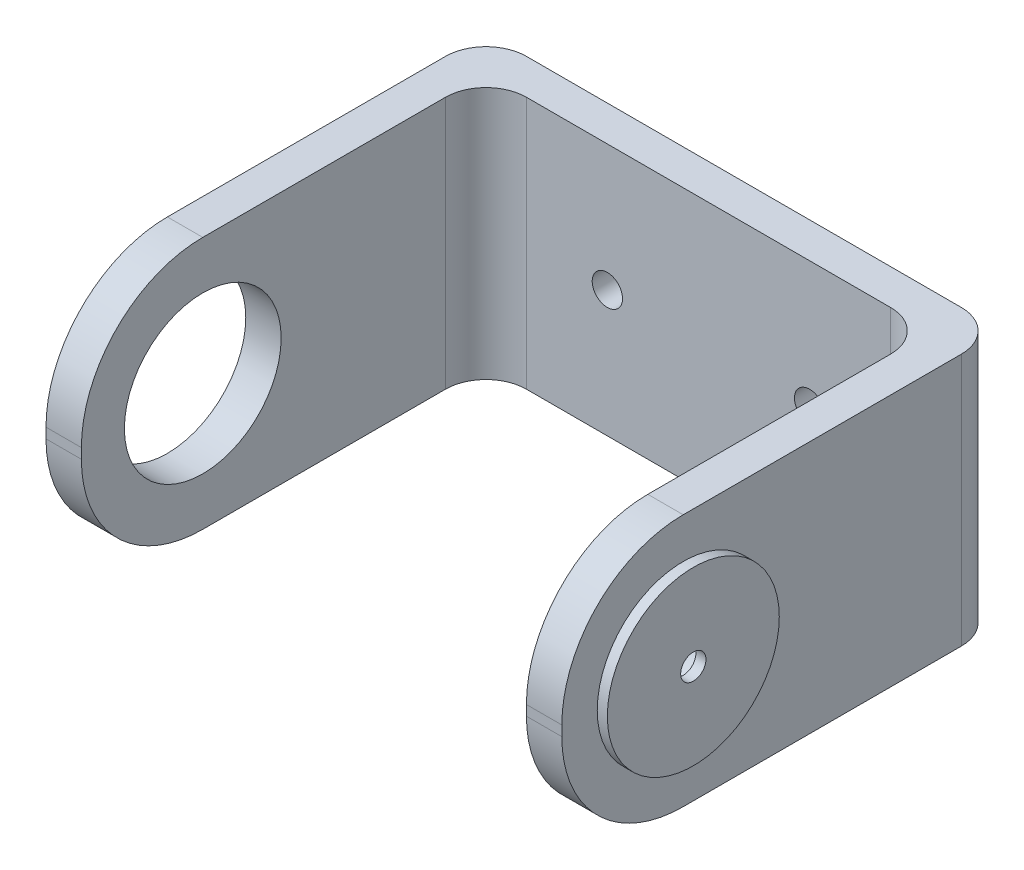
ISO-10303-21;
HEADER;
FILE_DESCRIPTION(('STEP AP214'),'2;1');
FILE_NAME('part.step','',(''),(''),'','','');
FILE_SCHEMA(('AUTOMOTIVE_DESIGN { 1 0 10303 214 1 1 1 1 }'));
ENDSEC;
DATA;
#1=APPLICATION_CONTEXT('core data for automotive mechanical design processes');
#2=APPLICATION_PROTOCOL_DEFINITION('international standard','automotive_design',2000,#1);
#3=PRODUCT_CONTEXT('',#1,'mechanical');
#4=PRODUCT('Part','Part','',(#3));
#5=PRODUCT_RELATED_PRODUCT_CATEGORY('part','',(#4));
#6=PRODUCT_DEFINITION_FORMATION('','',#4);
#7=PRODUCT_DEFINITION_CONTEXT('part definition',#1,'design');
#8=PRODUCT_DEFINITION('design','',#6,#7);
#9=PRODUCT_DEFINITION_SHAPE('','',#8);
#10=(LENGTH_UNIT() NAMED_UNIT(*) SI_UNIT(.MILLI.,.METRE.));
#11=(NAMED_UNIT(*) PLANE_ANGLE_UNIT() SI_UNIT($,.RADIAN.));
#12=(NAMED_UNIT(*) SI_UNIT($,.STERADIAN.) SOLID_ANGLE_UNIT());
#13=UNCERTAINTY_MEASURE_WITH_UNIT(LENGTH_MEASURE(1.E-05),#10,'distance_accuracy_value','');
#14=(GEOMETRIC_REPRESENTATION_CONTEXT(3) GLOBAL_UNCERTAINTY_ASSIGNED_CONTEXT((#13)) GLOBAL_UNIT_ASSIGNED_CONTEXT((#10,
#11,#12)) REPRESENTATION_CONTEXT('',''));
#15=CARTESIAN_POINT('',(0.,0.,0.));
#16=DIRECTION('',(0.,0.,1.));
#17=DIRECTION('',(1.,0.,0.));
#18=AXIS2_PLACEMENT_3D('',#15,#16,#17);
#19=CARTESIAN_POINT('',(0.,25.,40.));
#20=DIRECTION('',(0.,0.,-1.));
#21=DIRECTION('',(-1.,0.,0.));
#22=AXIS2_PLACEMENT_3D('',#19,#20,#21);
#23=PLANE('',#22);
#24=DIRECTION('',(0.,-1.,0.));
#25=VECTOR('',#24,1.);
#26=CARTESIAN_POINT('',(-25.5,25.,40.));
#27=LINE('',#26,#25);
#28=CARTESIAN_POINT('',(-25.5,13.,40.));
#29=VERTEX_POINT('',#28);
#30=CARTESIAN_POINT('',(-25.5,12.,40.));
#31=VERTEX_POINT('',#30);
#32=EDGE_CURVE('E195',#29,#31,#27,.T.);
#33=ORIENTED_EDGE('',*,*,#32,.T.);
#34=DIRECTION('',(1.,0.,0.));
#35=VECTOR('',#34,1.);
#36=CARTESIAN_POINT('',(0.,12.,40.));
#37=LINE('',#36,#35);
#38=CARTESIAN_POINT('',(-22.,12.,40.));
#39=VERTEX_POINT('',#38);
#40=EDGE_CURVE('E160',#31,#39,#37,.T.);
#41=ORIENTED_EDGE('',*,*,#40,.T.);
#42=DIRECTION('',(0.,-1.,0.));
#43=VECTOR('',#42,1.);
#44=CARTESIAN_POINT('',(-22.,25.,40.));
#45=LINE('',#44,#43);
#46=CARTESIAN_POINT('',(-22.,13.,40.));
#47=VERTEX_POINT('',#46);
#48=EDGE_CURVE('E171',#47,#39,#45,.T.);
#49=ORIENTED_EDGE('',*,*,#48,.F.);
#50=DIRECTION('',(1.,0.,0.));
#51=VECTOR('',#50,1.);
#52=CARTESIAN_POINT('',(-25.5,13.,40.));
#53=LINE('',#52,#51);
#54=EDGE_CURVE('E154',#47,#29,#53,.F.);
#55=ORIENTED_EDGE('',*,*,#54,.T.);
#56=EDGE_LOOP('',(#33,#41,#49,#55));
#57=FACE_BOUND('',#56,.T.);
#58=ADVANCED_FACE('F34',(#57),#23,.F.);
#59=CARTESIAN_POINT('',(-22.,25.,0.));
#60=DIRECTION('',(-1.,0.,0.));
#61=DIRECTION('',(0.,0.,1.));
#62=AXIS2_PLACEMENT_3D('',#59,#60,#61);
#63=PLANE('',#62);
#64=CARTESIAN_POINT('',(-22.,12.5,28.));
#65=DIRECTION('',(-1.,0.,0.));
#66=DIRECTION('',(0.,0.,1.));
#67=AXIS2_PLACEMENT_3D('',#64,#65,#66);
#68=CIRCLE('',#67,7.75);
#69=CARTESIAN_POINT('',(-22.,12.5,35.75));
#70=VERTEX_POINT('',#69);
#71=EDGE_CURVE('E186',#70,#70,#68,.T.);
#72=ORIENTED_EDGE('',*,*,#71,.T.);
#73=EDGE_LOOP('',(#72));
#74=FACE_BOUND('',#73,.T.);
#75=DIRECTION('',(0.,0.,-1.));
#76=VECTOR('',#75,1.);
#77=CARTESIAN_POINT('',(-22.,0.,0.));
#78=LINE('',#77,#76);
#79=CARTESIAN_POINT('',(-22.,0.,28.));
#80=VERTEX_POINT('',#79);
#81=CARTESIAN_POINT('',(-22.,0.,4.));
#82=VERTEX_POINT('',#81);
#83=EDGE_CURVE('E196',#80,#82,#78,.T.);
#84=ORIENTED_EDGE('',*,*,#83,.T.);
#85=DIRECTION('',(0.,-1.,0.));
#86=VECTOR('',#85,1.);
#87=CARTESIAN_POINT('',(-22.,25.,4.));
#88=LINE('',#87,#86);
#89=CARTESIAN_POINT('',(-22.,25.,4.));
#90=VERTEX_POINT('',#89);
#91=EDGE_CURVE('E176',#82,#90,#88,.F.);
#92=ORIENTED_EDGE('',*,*,#91,.T.);
#93=DIRECTION('',(0.,0.,-1.));
#94=VECTOR('',#93,1.);
#95=CARTESIAN_POINT('',(-22.,25.,0.));
#96=LINE('',#95,#94);
#97=CARTESIAN_POINT('',(-22.,25.,28.));
#98=VERTEX_POINT('',#97);
#99=EDGE_CURVE('E165',#98,#90,#96,.T.);
#100=ORIENTED_EDGE('',*,*,#99,.F.);
#101=CARTESIAN_POINT('',(-22.,13.,28.));
#102=DIRECTION('',(-1.,0.,0.));
#103=DIRECTION('',(0.,0.,1.));
#104=AXIS2_PLACEMENT_3D('',#101,#102,#103);
#105=CIRCLE('',#104,12.);
#106=EDGE_CURVE('E149',#98,#47,#105,.F.);
#107=ORIENTED_EDGE('',*,*,#106,.T.);
#108=ORIENTED_EDGE('',*,*,#48,.T.);
#109=CARTESIAN_POINT('',(-22.,12.,28.));
#110=DIRECTION('',(-1.,0.,0.));
#111=DIRECTION('',(0.,0.,1.));
#112=AXIS2_PLACEMENT_3D('',#109,#110,#111);
#113=CIRCLE('',#112,12.);
#114=EDGE_CURVE('E159',#39,#80,#113,.F.);
#115=ORIENTED_EDGE('',*,*,#114,.T.);
#116=EDGE_LOOP('',(#84,#92,#100,#107,#108,#115));
#117=FACE_BOUND('',#116,.T.);
#118=ADVANCED_FACE('F174',(#74,#117),#63,.F.);
#119=CARTESIAN_POINT('',(0.,25.,0.));
#120=DIRECTION('',(0.,0.,-1.));
#121=DIRECTION('',(-1.,0.,0.));
#122=AXIS2_PLACEMENT_3D('',#119,#120,#121);
#123=PLANE('',#122);
#124=CARTESIAN_POINT('',(10.,12.5,0.));
#125=DIRECTION('',(0.,0.,-1.));
#126=DIRECTION('',(-1.,0.,0.));
#127=AXIS2_PLACEMENT_3D('',#124,#125,#126);
#128=CIRCLE('',#127,1.5);
#129=CARTESIAN_POINT('',(8.5,12.5,0.));
#130=VERTEX_POINT('',#129);
#131=EDGE_CURVE('E416',#130,#130,#128,.T.);
#132=ORIENTED_EDGE('',*,*,#131,.T.);
#133=EDGE_LOOP('',(#132));
#134=FACE_BOUND('',#133,.T.);
#135=CARTESIAN_POINT('',(-10.,12.5,0.));
#136=DIRECTION('',(0.,0.,-1.));
#137=DIRECTION('',(-1.,0.,0.));
#138=AXIS2_PLACEMENT_3D('',#135,#136,#137);
#139=CIRCLE('',#138,1.5);
#140=CARTESIAN_POINT('',(-11.5,12.5,0.));
#141=VERTEX_POINT('',#140);
#142=EDGE_CURVE('E419',#141,#141,#139,.T.);
#143=ORIENTED_EDGE('',*,*,#142,.T.);
#144=EDGE_LOOP('',(#143));
#145=FACE_BOUND('',#144,.T.);
#146=DIRECTION('',(1.,0.,0.));
#147=VECTOR('',#146,1.);
#148=CARTESIAN_POINT('',(0.,0.,0.));
#149=LINE('',#148,#147);
#150=CARTESIAN_POINT('',(-18.,0.,0.));
#151=VERTEX_POINT('',#150);
#152=CARTESIAN_POINT('',(18.,0.,0.));
#153=VERTEX_POINT('',#152);
#154=EDGE_CURVE('E198',#151,#153,#149,.T.);
#155=ORIENTED_EDGE('',*,*,#154,.T.);
#156=DIRECTION('',(0.,-1.,0.));
#157=VECTOR('',#156,1.);
#158=CARTESIAN_POINT('',(18.,25.,0.));
#159=LINE('',#158,#157);
#160=CARTESIAN_POINT('',(18.,25.,0.));
#161=VERTEX_POINT('',#160);
#162=EDGE_CURVE('E252',#153,#161,#159,.F.);
#163=ORIENTED_EDGE('',*,*,#162,.T.);
#164=DIRECTION('',(1.,0.,0.));
#165=VECTOR('',#164,1.);
#166=CARTESIAN_POINT('',(0.,25.,0.));
#167=LINE('',#166,#165);
#168=CARTESIAN_POINT('',(-18.,25.,0.));
#169=VERTEX_POINT('',#168);
#170=EDGE_CURVE('E177',#169,#161,#167,.T.);
#171=ORIENTED_EDGE('',*,*,#170,.F.);
#172=DIRECTION('',(0.,-1.,0.));
#173=VECTOR('',#172,1.);
#174=CARTESIAN_POINT('',(-18.,0.,0.));
#175=LINE('',#174,#173);
#176=EDGE_CURVE('E249',#169,#151,#175,.T.);
#177=ORIENTED_EDGE('',*,*,#176,.T.);
#178=EDGE_LOOP('',(#155,#163,#171,#177));
#179=FACE_BOUND('',#178,.T.);
#180=ADVANCED_FACE('F317',(#134,#145,#179),#123,.F.);
#181=CARTESIAN_POINT('',(22.,25.,0.));
#182=DIRECTION('',(1.,0.,0.));
#183=DIRECTION('',(0.,0.,-1.));
#184=AXIS2_PLACEMENT_3D('',#181,#182,#183);
#185=PLANE('',#184);
#186=CARTESIAN_POINT('',(22.,12.5,28.));
#187=DIRECTION('',(1.,0.,0.));
#188=DIRECTION('',(0.,0.,-1.));
#189=AXIS2_PLACEMENT_3D('',#186,#187,#188);
#190=CIRCLE('',#189,2.8);
#191=CARTESIAN_POINT('',(22.,12.5,25.2));
#192=VERTEX_POINT('',#191);
#193=EDGE_CURVE('E442',#192,#192,#190,.T.);
#194=ORIENTED_EDGE('',*,*,#193,.T.);
#195=EDGE_LOOP('',(#194));
#196=FACE_BOUND('',#195,.T.);
#197=DIRECTION('',(0.,0.,1.));
#198=VECTOR('',#197,1.);
#199=CARTESIAN_POINT('',(22.,25.,0.));
#200=LINE('',#199,#198);
#201=CARTESIAN_POINT('',(22.,25.,3.99999999999999));
#202=VERTEX_POINT('',#201);
#203=CARTESIAN_POINT('',(22.,25.,28.));
#204=VERTEX_POINT('',#203);
#205=EDGE_CURVE('E181',#202,#204,#200,.T.);
#206=ORIENTED_EDGE('',*,*,#205,.F.);
#207=DIRECTION('',(0.,-1.,0.));
#208=VECTOR('',#207,1.);
#209=CARTESIAN_POINT('',(22.,0.,3.99999999999999));
#210=LINE('',#209,#208);
#211=CARTESIAN_POINT('',(22.,0.,3.99999999999999));
#212=VERTEX_POINT('',#211);
#213=EDGE_CURVE('E246',#202,#212,#210,.T.);
#214=ORIENTED_EDGE('',*,*,#213,.T.);
#215=DIRECTION('',(0.,0.,1.));
#216=VECTOR('',#215,1.);
#217=CARTESIAN_POINT('',(22.,0.,0.));
#218=LINE('',#217,#216);
#219=CARTESIAN_POINT('',(22.,0.,28.));
#220=VERTEX_POINT('',#219);
#221=EDGE_CURVE('E201',#212,#220,#218,.T.);
#222=ORIENTED_EDGE('',*,*,#221,.T.);
#223=CARTESIAN_POINT('',(22.,12.,28.));
#224=DIRECTION('',(1.,0.,0.));
#225=DIRECTION('',(0.,0.,-1.));
#226=AXIS2_PLACEMENT_3D('',#223,#224,#225);
#227=CIRCLE('',#226,12.);
#228=CARTESIAN_POINT('',(22.,12.,40.));
#229=VERTEX_POINT('',#228);
#230=EDGE_CURVE('E226',#220,#229,#227,.F.);
#231=ORIENTED_EDGE('',*,*,#230,.T.);
#232=DIRECTION('',(0.,-1.,0.));
#233=VECTOR('',#232,1.);
#234=CARTESIAN_POINT('',(22.,25.,40.));
#235=LINE('',#234,#233);
#236=CARTESIAN_POINT('',(22.,13.,40.));
#237=VERTEX_POINT('',#236);
#238=EDGE_CURVE('E211',#237,#229,#235,.T.);
#239=ORIENTED_EDGE('',*,*,#238,.F.);
#240=CARTESIAN_POINT('',(22.,13.,28.));
#241=DIRECTION('',(1.,0.,0.));
#242=DIRECTION('',(0.,0.,-1.));
#243=AXIS2_PLACEMENT_3D('',#240,#241,#242);
#244=CIRCLE('',#243,12.);
#245=EDGE_CURVE('E228',#237,#204,#244,.F.);
#246=ORIENTED_EDGE('',*,*,#245,.T.);
#247=EDGE_LOOP('',(#206,#214,#222,#231,#239,#246));
#248=FACE_BOUND('',#247,.T.);
#249=ADVANCED_FACE('F305',(#196,#248),#185,.F.);
#250=CARTESIAN_POINT('',(0.,25.,40.));
#251=DIRECTION('',(0.,0.,-1.));
#252=DIRECTION('',(-1.,0.,0.));
#253=AXIS2_PLACEMENT_3D('',#250,#251,#252);
#254=PLANE('',#253);
#255=DIRECTION('',(0.,-1.,0.));
#256=VECTOR('',#255,1.);
#257=CARTESIAN_POINT('',(25.5,25.,40.));
#258=LINE('',#257,#256);
#259=CARTESIAN_POINT('',(25.5,13.,40.));
#260=VERTEX_POINT('',#259);
#261=CARTESIAN_POINT('',(25.5,12.,40.));
#262=VERTEX_POINT('',#261);
#263=EDGE_CURVE('E208',#260,#262,#258,.T.);
#264=ORIENTED_EDGE('',*,*,#263,.F.);
#265=DIRECTION('',(1.,0.,0.));
#266=VECTOR('',#265,1.);
#267=CARTESIAN_POINT('',(22.,13.,40.));
#268=LINE('',#267,#266);
#269=EDGE_CURVE('E224',#260,#237,#268,.F.);
#270=ORIENTED_EDGE('',*,*,#269,.T.);
#271=ORIENTED_EDGE('',*,*,#238,.T.);
#272=DIRECTION('',(1.,0.,0.));
#273=VECTOR('',#272,1.);
#274=CARTESIAN_POINT('',(0.,12.,40.));
#275=LINE('',#274,#273);
#276=EDGE_CURVE('E221',#229,#262,#275,.T.);
#277=ORIENTED_EDGE('',*,*,#276,.T.);
#278=EDGE_LOOP('',(#264,#270,#271,#277));
#279=FACE_BOUND('',#278,.T.);
#280=ADVANCED_FACE('F299',(#279),#254,.F.);
#281=CARTESIAN_POINT('',(25.5,25.,0.));
#282=DIRECTION('',(-1.,0.,0.));
#283=DIRECTION('',(0.,0.,1.));
#284=AXIS2_PLACEMENT_3D('',#281,#282,#283);
#285=PLANE('',#284);
#286=CARTESIAN_POINT('',(25.5,12.5,28.));
#287=DIRECTION('',(1.,0.,0.));
#288=DIRECTION('',(0.,0.,-1.));
#289=AXIS2_PLACEMENT_3D('',#286,#287,#288);
#290=CIRCLE('',#289,8.5);
#291=CARTESIAN_POINT('',(25.5,12.5,19.5));
#292=VERTEX_POINT('',#291);
#293=EDGE_CURVE('E245',#292,#292,#290,.T.);
#294=ORIENTED_EDGE('',*,*,#293,.F.);
#295=EDGE_LOOP('',(#294));
#296=FACE_BOUND('',#295,.T.);
#297=DIRECTION('',(0.,0.,-1.));
#298=VECTOR('',#297,1.);
#299=CARTESIAN_POINT('',(25.5,0.,0.));
#300=LINE('',#299,#298);
#301=CARTESIAN_POINT('',(25.5,0.,28.));
#302=VERTEX_POINT('',#301);
#303=CARTESIAN_POINT('',(25.5,0.,0.5));
#304=VERTEX_POINT('',#303);
#305=EDGE_CURVE('E203',#302,#304,#300,.T.);
#306=ORIENTED_EDGE('',*,*,#305,.T.);
#307=DIRECTION('',(0.,-1.,0.));
#308=VECTOR('',#307,1.);
#309=CARTESIAN_POINT('',(25.5,25.,0.5));
#310=LINE('',#309,#308);
#311=CARTESIAN_POINT('',(25.5,25.,0.5));
#312=VERTEX_POINT('',#311);
#313=EDGE_CURVE('E11',#304,#312,#310,.F.);
#314=ORIENTED_EDGE('',*,*,#313,.T.);
#315=DIRECTION('',(0.,0.,-1.));
#316=VECTOR('',#315,1.);
#317=CARTESIAN_POINT('',(25.5,25.,0.));
#318=LINE('',#317,#316);
#319=CARTESIAN_POINT('',(25.5,25.,28.));
#320=VERTEX_POINT('',#319);
#321=EDGE_CURVE('E190',#320,#312,#318,.T.);
#322=ORIENTED_EDGE('',*,*,#321,.F.);
#323=CARTESIAN_POINT('',(25.5,13.,28.));
#324=DIRECTION('',(-1.,0.,0.));
#325=DIRECTION('',(0.,0.,1.));
#326=AXIS2_PLACEMENT_3D('',#323,#324,#325);
#327=CIRCLE('',#326,12.);
#328=EDGE_CURVE('E219',#320,#260,#327,.F.);
#329=ORIENTED_EDGE('',*,*,#328,.T.);
#330=ORIENTED_EDGE('',*,*,#263,.T.);
#331=CARTESIAN_POINT('',(25.5,12.,28.));
#332=DIRECTION('',(-1.,0.,0.));
#333=DIRECTION('',(0.,0.,1.));
#334=AXIS2_PLACEMENT_3D('',#331,#332,#333);
#335=CIRCLE('',#334,12.);
#336=EDGE_CURVE('E217',#262,#302,#335,.F.);
#337=ORIENTED_EDGE('',*,*,#336,.T.);
#338=EDGE_LOOP('',(#306,#314,#322,#329,#330,#337));
#339=FACE_BOUND('',#338,.T.);
#340=ADVANCED_FACE('F292',(#296,#339),#285,.F.);
#341=CARTESIAN_POINT('',(0.,25.,-3.5));
#342=DIRECTION('',(0.,0.,1.));
#343=DIRECTION('',(1.,0.,0.));
#344=AXIS2_PLACEMENT_3D('',#341,#342,#343);
#345=PLANE('',#344);
#346=CARTESIAN_POINT('',(10.,12.5,-3.5));
#347=DIRECTION('',(0.,0.,-1.));
#348=DIRECTION('',(-1.,0.,0.));
#349=AXIS2_PLACEMENT_3D('',#346,#347,#348);
#350=CIRCLE('',#349,1.5);
#351=CARTESIAN_POINT('',(8.5,12.5,-3.5));
#352=VERTEX_POINT('',#351);
#353=EDGE_CURVE('E420',#352,#352,#350,.T.);
#354=ORIENTED_EDGE('',*,*,#353,.F.);
#355=EDGE_LOOP('',(#354));
#356=FACE_BOUND('',#355,.T.);
#357=CARTESIAN_POINT('',(-10.,12.5,-3.5));
#358=DIRECTION('',(0.,0.,-1.));
#359=DIRECTION('',(-1.,0.,0.));
#360=AXIS2_PLACEMENT_3D('',#357,#358,#359);
#361=CIRCLE('',#360,1.5);
#362=CARTESIAN_POINT('',(-11.5,12.5,-3.5));
#363=VERTEX_POINT('',#362);
#364=EDGE_CURVE('E425',#363,#363,#361,.T.);
#365=ORIENTED_EDGE('',*,*,#364,.F.);
#366=EDGE_LOOP('',(#365));
#367=FACE_BOUND('',#366,.T.);
#368=DIRECTION('',(-1.,0.,0.));
#369=VECTOR('',#368,1.);
#370=CARTESIAN_POINT('',(0.,0.,-3.5));
#371=LINE('',#370,#369);
#372=CARTESIAN_POINT('',(21.5,0.,-3.5));
#373=VERTEX_POINT('',#372);
#374=CARTESIAN_POINT('',(-21.5,0.,-3.49999999999999));
#375=VERTEX_POINT('',#374);
#376=EDGE_CURVE('E183',#373,#375,#371,.T.);
#377=ORIENTED_EDGE('',*,*,#376,.T.);
#378=DIRECTION('',(0.,-1.,0.));
#379=VECTOR('',#378,1.);
#380=CARTESIAN_POINT('',(-21.5,25.,-3.49999999999999));
#381=LINE('',#380,#379);
#382=CARTESIAN_POINT('',(-21.5,25.,-3.49999999999999));
#383=VERTEX_POINT('',#382);
#384=EDGE_CURVE('E55',#375,#383,#381,.F.);
#385=ORIENTED_EDGE('',*,*,#384,.T.);
#386=DIRECTION('',(-1.,0.,0.));
#387=VECTOR('',#386,1.);
#388=CARTESIAN_POINT('',(0.,25.,-3.5));
#389=LINE('',#388,#387);
#390=CARTESIAN_POINT('',(21.5,25.,-3.5));
#391=VERTEX_POINT('',#390);
#392=EDGE_CURVE('E192',#391,#383,#389,.T.);
#393=ORIENTED_EDGE('',*,*,#392,.F.);
#394=DIRECTION('',(0.,-1.,0.));
#395=VECTOR('',#394,1.);
#396=CARTESIAN_POINT('',(21.5,25.,-3.5));
#397=LINE('',#396,#395);
#398=EDGE_CURVE('E270',#391,#373,#397,.T.);
#399=ORIENTED_EDGE('',*,*,#398,.T.);
#400=EDGE_LOOP('',(#377,#385,#393,#399));
#401=FACE_BOUND('',#400,.T.);
#402=ADVANCED_FACE('F286',(#356,#367,#401),#345,.F.);
#403=CARTESIAN_POINT('',(-25.5,25.,0.));
#404=DIRECTION('',(1.,0.,0.));
#405=DIRECTION('',(0.,0.,-1.));
#406=AXIS2_PLACEMENT_3D('',#403,#404,#405);
#407=PLANE('',#406);
#408=CARTESIAN_POINT('',(-25.5,12.5,28.));
#409=DIRECTION('',(-1.,0.,0.));
#410=DIRECTION('',(0.,0.,1.));
#411=AXIS2_PLACEMENT_3D('',#408,#409,#410);
#412=CIRCLE('',#411,7.75);
#413=CARTESIAN_POINT('',(-25.5,12.5,35.75));
#414=VERTEX_POINT('',#413);
#415=EDGE_CURVE('E444',#414,#414,#412,.T.);
#416=ORIENTED_EDGE('',*,*,#415,.F.);
#417=EDGE_LOOP('',(#416));
#418=FACE_BOUND('',#417,.T.);
#419=DIRECTION('',(0.,0.,1.));
#420=VECTOR('',#419,1.);
#421=CARTESIAN_POINT('',(-25.5,25.,0.));
#422=LINE('',#421,#420);
#423=CARTESIAN_POINT('',(-25.5,25.,0.500000000000006));
#424=VERTEX_POINT('',#423);
#425=CARTESIAN_POINT('',(-25.5,25.,28.));
#426=VERTEX_POINT('',#425);
#427=EDGE_CURVE('E168',#424,#426,#422,.T.);
#428=ORIENTED_EDGE('',*,*,#427,.F.);
#429=DIRECTION('',(0.,-1.,0.));
#430=VECTOR('',#429,1.);
#431=CARTESIAN_POINT('',(-25.5,25.,0.500000000000006));
#432=LINE('',#431,#430);
#433=CARTESIAN_POINT('',(-25.5,0.,0.500000000000006));
#434=VERTEX_POINT('',#433);
#435=EDGE_CURVE('E263',#424,#434,#432,.T.);
#436=ORIENTED_EDGE('',*,*,#435,.T.);
#437=DIRECTION('',(0.,0.,1.));
#438=VECTOR('',#437,1.);
#439=CARTESIAN_POINT('',(-25.5,0.,0.));
#440=LINE('',#439,#438);
#441=CARTESIAN_POINT('',(-25.5,0.,28.));
#442=VERTEX_POINT('',#441);
#443=EDGE_CURVE('E178',#434,#442,#440,.T.);
#444=ORIENTED_EDGE('',*,*,#443,.T.);
#445=CARTESIAN_POINT('',(-25.5,12.,28.));
#446=DIRECTION('',(1.,0.,0.));
#447=DIRECTION('',(0.,0.,-1.));
#448=AXIS2_PLACEMENT_3D('',#445,#446,#447);
#449=CIRCLE('',#448,12.);
#450=EDGE_CURVE('E243',#442,#31,#449,.F.);
#451=ORIENTED_EDGE('',*,*,#450,.T.);
#452=ORIENTED_EDGE('',*,*,#32,.F.);
#453=CARTESIAN_POINT('',(-25.5,13.,28.));
#454=DIRECTION('',(1.,0.,0.));
#455=DIRECTION('',(0.,0.,-1.));
#456=AXIS2_PLACEMENT_3D('',#453,#454,#455);
#457=CIRCLE('',#456,12.);
#458=EDGE_CURVE('E241',#29,#426,#457,.F.);
#459=ORIENTED_EDGE('',*,*,#458,.T.);
#460=EDGE_LOOP('',(#428,#436,#444,#451,#452,#459));
#461=FACE_BOUND('',#460,.T.);
#462=ADVANCED_FACE('F279',(#418,#461),#407,.F.);
#463=CARTESIAN_POINT('',(0.,25.,0.));
#464=DIRECTION('',(0.,1.,0.));
#465=DIRECTION('',(0.,0.,1.));
#466=AXIS2_PLACEMENT_3D('',#463,#464,#465);
#467=PLANE('',#466);
#468=ORIENTED_EDGE('',*,*,#392,.T.);
#469=CARTESIAN_POINT('',(-21.5,25.,0.500000000000006));
#470=DIRECTION('',(0.,1.,0.));
#471=DIRECTION('',(0.,0.,1.));
#472=AXIS2_PLACEMENT_3D('',#469,#470,#471);
#473=CIRCLE('',#472,4.);
#474=EDGE_CURVE('E42',#383,#424,#473,.T.);
#475=ORIENTED_EDGE('',*,*,#474,.T.);
#476=ORIENTED_EDGE('',*,*,#427,.T.);
#477=DIRECTION('',(1.,0.,0.));
#478=VECTOR('',#477,1.);
#479=CARTESIAN_POINT('',(-22.,25.,28.));
#480=LINE('',#479,#478);
#481=EDGE_CURVE('E153',#426,#98,#480,.T.);
#482=ORIENTED_EDGE('',*,*,#481,.T.);
#483=ORIENTED_EDGE('',*,*,#99,.T.);
#484=CARTESIAN_POINT('',(-18.,25.,4.));
#485=DIRECTION('',(0.,1.,0.));
#486=DIRECTION('',(0.,0.,1.));
#487=AXIS2_PLACEMENT_3D('',#484,#485,#486);
#488=CIRCLE('',#487,4.);
#489=EDGE_CURVE('E261',#90,#169,#488,.F.);
#490=ORIENTED_EDGE('',*,*,#489,.T.);
#491=ORIENTED_EDGE('',*,*,#170,.T.);
#492=CARTESIAN_POINT('',(18.,25.,3.99999999999999));
#493=DIRECTION('',(0.,1.,0.));
#494=DIRECTION('',(0.,0.,1.));
#495=AXIS2_PLACEMENT_3D('',#492,#493,#494);
#496=CIRCLE('',#495,4.);
#497=EDGE_CURVE('E257',#161,#202,#496,.F.);
#498=ORIENTED_EDGE('',*,*,#497,.T.);
#499=ORIENTED_EDGE('',*,*,#205,.T.);
#500=DIRECTION('',(1.,0.,0.));
#501=VECTOR('',#500,1.);
#502=CARTESIAN_POINT('',(25.5,25.,28.));
#503=LINE('',#502,#501);
#504=EDGE_CURVE('E170',#204,#320,#503,.T.);
#505=ORIENTED_EDGE('',*,*,#504,.T.);
#506=ORIENTED_EDGE('',*,*,#321,.T.);
#507=CARTESIAN_POINT('',(21.5,25.,0.5));
#508=DIRECTION('',(0.,1.,0.));
#509=DIRECTION('',(0.,0.,1.));
#510=AXIS2_PLACEMENT_3D('',#507,#508,#509);
#511=CIRCLE('',#510,4.);
#512=EDGE_CURVE('E274',#312,#391,#511,.T.);
#513=ORIENTED_EDGE('',*,*,#512,.T.);
#514=EDGE_LOOP('',(#468,#475,#476,#482,#483,#490,#491,#498,#499,#505,#506,#513));
#515=FACE_BOUND('',#514,.T.);
#516=ADVANCED_FACE('F164',(#515),#467,.T.);
#517=CARTESIAN_POINT('',(0.,0.,0.));
#518=DIRECTION('',(0.,1.,0.));
#519=DIRECTION('',(0.,0.,1.));
#520=AXIS2_PLACEMENT_3D('',#517,#518,#519);
#521=PLANE('',#520);
#522=ORIENTED_EDGE('',*,*,#443,.F.);
#523=CARTESIAN_POINT('',(-21.5,0.,0.500000000000006));
#524=DIRECTION('',(0.,1.,0.));
#525=DIRECTION('',(0.,0.,1.));
#526=AXIS2_PLACEMENT_3D('',#523,#524,#525);
#527=CIRCLE('',#526,4.);
#528=EDGE_CURVE('E268',#434,#375,#527,.F.);
#529=ORIENTED_EDGE('',*,*,#528,.T.);
#530=ORIENTED_EDGE('',*,*,#376,.F.);
#531=CARTESIAN_POINT('',(21.5,0.,0.5));
#532=DIRECTION('',(0.,1.,0.));
#533=DIRECTION('',(0.,0.,1.));
#534=AXIS2_PLACEMENT_3D('',#531,#532,#533);
#535=CIRCLE('',#534,4.);
#536=EDGE_CURVE('E266',#373,#304,#535,.F.);
#537=ORIENTED_EDGE('',*,*,#536,.T.);
#538=ORIENTED_EDGE('',*,*,#305,.F.);
#539=DIRECTION('',(1.,0.,0.));
#540=VECTOR('',#539,1.);
#541=CARTESIAN_POINT('',(0.,0.,28.));
#542=LINE('',#541,#540);
#543=EDGE_CURVE('E234',#302,#220,#542,.F.);
#544=ORIENTED_EDGE('',*,*,#543,.T.);
#545=ORIENTED_EDGE('',*,*,#221,.F.);
#546=CARTESIAN_POINT('',(18.,0.,3.99999999999999));
#547=DIRECTION('',(0.,1.,0.));
#548=DIRECTION('',(0.,0.,1.));
#549=AXIS2_PLACEMENT_3D('',#546,#547,#548);
#550=CIRCLE('',#549,4.);
#551=EDGE_CURVE('E255',#212,#153,#550,.T.);
#552=ORIENTED_EDGE('',*,*,#551,.T.);
#553=ORIENTED_EDGE('',*,*,#154,.F.);
#554=CARTESIAN_POINT('',(-18.,0.,4.));
#555=DIRECTION('',(0.,1.,0.));
#556=DIRECTION('',(0.,0.,1.));
#557=AXIS2_PLACEMENT_3D('',#554,#555,#556);
#558=CIRCLE('',#557,4.);
#559=EDGE_CURVE('E259',#151,#82,#558,.T.);
#560=ORIENTED_EDGE('',*,*,#559,.T.);
#561=ORIENTED_EDGE('',*,*,#83,.F.);
#562=DIRECTION('',(1.,0.,0.));
#563=VECTOR('',#562,1.);
#564=CARTESIAN_POINT('',(0.,0.,28.));
#565=LINE('',#564,#563);
#566=EDGE_CURVE('E231',#80,#442,#565,.F.);
#567=ORIENTED_EDGE('',*,*,#566,.T.);
#568=EDGE_LOOP('',(#522,#529,#530,#537,#538,#544,#545,#552,#553,#560,#561,#567));
#569=FACE_BOUND('',#568,.T.);
#570=ADVANCED_FACE('F285',(#569),#521,.F.);
#571=CARTESIAN_POINT('',(0.,13.,28.));
#572=DIRECTION('',(-1.,0.,0.));
#573=DIRECTION('',(0.,0.,1.));
#574=AXIS2_PLACEMENT_3D('',#571,#572,#573);
#575=CYLINDRICAL_SURFACE('',#574,12.);
#576=ORIENTED_EDGE('',*,*,#245,.F.);
#577=ORIENTED_EDGE('',*,*,#269,.F.);
#578=ORIENTED_EDGE('',*,*,#328,.F.);
#579=ORIENTED_EDGE('',*,*,#504,.F.);
#580=EDGE_LOOP('',(#576,#577,#578,#579));
#581=FACE_BOUND('',#580,.T.);
#582=ADVANCED_FACE('F308',(#581),#575,.T.);
#583=CARTESIAN_POINT('',(0.,12.,28.));
#584=DIRECTION('',(1.,0.,0.));
#585=DIRECTION('',(0.,0.,-1.));
#586=AXIS2_PLACEMENT_3D('',#583,#584,#585);
#587=CYLINDRICAL_SURFACE('',#586,12.);
#588=ORIENTED_EDGE('',*,*,#230,.F.);
#589=ORIENTED_EDGE('',*,*,#543,.F.);
#590=ORIENTED_EDGE('',*,*,#336,.F.);
#591=ORIENTED_EDGE('',*,*,#276,.F.);
#592=EDGE_LOOP('',(#588,#589,#590,#591));
#593=FACE_BOUND('',#592,.T.);
#594=ADVANCED_FACE('F297',(#593),#587,.T.);
#595=CARTESIAN_POINT('',(0.,12.,28.));
#596=DIRECTION('',(1.,0.,0.));
#597=DIRECTION('',(0.,0.,-1.));
#598=AXIS2_PLACEMENT_3D('',#595,#596,#597);
#599=CYLINDRICAL_SURFACE('',#598,12.);
#600=ORIENTED_EDGE('',*,*,#450,.F.);
#601=ORIENTED_EDGE('',*,*,#566,.F.);
#602=ORIENTED_EDGE('',*,*,#114,.F.);
#603=ORIENTED_EDGE('',*,*,#40,.F.);
#604=EDGE_LOOP('',(#600,#601,#602,#603));
#605=FACE_BOUND('',#604,.T.);
#606=ADVANCED_FACE('F327',(#605),#599,.T.);
#607=CARTESIAN_POINT('',(0.,13.,28.));
#608=DIRECTION('',(-1.,0.,0.));
#609=DIRECTION('',(0.,0.,1.));
#610=AXIS2_PLACEMENT_3D('',#607,#608,#609);
#611=CYLINDRICAL_SURFACE('',#610,12.);
#612=ORIENTED_EDGE('',*,*,#458,.F.);
#613=ORIENTED_EDGE('',*,*,#54,.F.);
#614=ORIENTED_EDGE('',*,*,#106,.F.);
#615=ORIENTED_EDGE('',*,*,#481,.F.);
#616=EDGE_LOOP('',(#612,#613,#614,#615));
#617=FACE_BOUND('',#616,.T.);
#618=ADVANCED_FACE('F152',(#617),#611,.T.);
#619=CARTESIAN_POINT('',(-15.5,12.5,28.));
#620=DIRECTION('',(-1.,0.,0.));
#621=DIRECTION('',(0.,0.,1.));
#622=AXIS2_PLACEMENT_3D('',#619,#620,#621);
#623=CYLINDRICAL_SURFACE('',#622,7.75);
#624=ORIENTED_EDGE('',*,*,#415,.T.);
#625=EDGE_LOOP('',(#624));
#626=FACE_BOUND('',#625,.T.);
#627=ORIENTED_EDGE('',*,*,#71,.F.);
#628=EDGE_LOOP('',(#627));
#629=FACE_BOUND('',#628,.T.);
#630=ADVANCED_FACE('F346',(#626,#629),#623,.F.);
#631=CARTESIAN_POINT('',(15.5,12.5,28.));
#632=DIRECTION('',(1.,0.,0.));
#633=DIRECTION('',(0.,0.,-1.));
#634=AXIS2_PLACEMENT_3D('',#631,#632,#633);
#635=CYLINDRICAL_SURFACE('',#634,2.8);
#636=CARTESIAN_POINT('',(25.5,12.5,28.));
#637=DIRECTION('',(1.,0.,0.));
#638=DIRECTION('',(0.,0.,-1.));
#639=AXIS2_PLACEMENT_3D('',#636,#637,#638);
#640=CIRCLE('',#639,2.8);
#641=CARTESIAN_POINT('',(25.5,12.5,25.2));
#642=VERTEX_POINT('',#641);
#643=EDGE_CURVE('E437',#642,#642,#640,.T.);
#644=ORIENTED_EDGE('',*,*,#643,.T.);
#645=EDGE_LOOP('',(#644));
#646=FACE_BOUND('',#645,.T.);
#647=ORIENTED_EDGE('',*,*,#193,.F.);
#648=EDGE_LOOP('',(#647));
#649=FACE_BOUND('',#648,.T.);
#650=ADVANCED_FACE('F378',(#646,#649),#635,.F.);
#651=CARTESIAN_POINT('',(26.5,12.5,28.));
#652=DIRECTION('',(1.,0.,0.));
#653=DIRECTION('',(0.,0.,-1.));
#654=AXIS2_PLACEMENT_3D('',#651,#652,#653);
#655=PLANE('',#654);
#656=CARTESIAN_POINT('',(26.5,12.5,28.));
#657=DIRECTION('',(1.,0.,0.));
#658=DIRECTION('',(0.,0.,-1.));
#659=AXIS2_PLACEMENT_3D('',#656,#657,#658);
#660=CIRCLE('',#659,1.25);
#661=CARTESIAN_POINT('',(26.5,12.5,26.75));
#662=VERTEX_POINT('',#661);
#663=EDGE_CURVE('E422',#662,#662,#660,.T.);
#664=ORIENTED_EDGE('',*,*,#663,.F.);
#665=EDGE_LOOP('',(#664));
#666=FACE_BOUND('',#665,.T.);
#667=CARTESIAN_POINT('',(26.5,12.5,28.));
#668=DIRECTION('',(1.,0.,0.));
#669=DIRECTION('',(0.,0.,-1.));
#670=AXIS2_PLACEMENT_3D('',#667,#668,#669);
#671=CIRCLE('',#670,8.5);
#672=CARTESIAN_POINT('',(26.5,12.5,19.5));
#673=VERTEX_POINT('',#672);
#674=EDGE_CURVE('E432',#673,#673,#671,.T.);
#675=ORIENTED_EDGE('',*,*,#674,.T.);
#676=EDGE_LOOP('',(#675));
#677=FACE_BOUND('',#676,.T.);
#678=ADVANCED_FACE('F374',(#666,#677),#655,.T.);
#679=CARTESIAN_POINT('',(26.5,12.5,28.));
#680=DIRECTION('',(-1.,0.,0.));
#681=DIRECTION('',(0.,0.,1.));
#682=AXIS2_PLACEMENT_3D('',#679,#680,#681);
#683=CYLINDRICAL_SURFACE('',#682,8.5);
#684=ORIENTED_EDGE('',*,*,#674,.F.);
#685=EDGE_LOOP('',(#684));
#686=FACE_BOUND('',#685,.T.);
#687=ORIENTED_EDGE('',*,*,#293,.T.);
#688=EDGE_LOOP('',(#687));
#689=FACE_BOUND('',#688,.T.);
#690=ADVANCED_FACE('F377',(#686,#689),#683,.T.);
#691=CARTESIAN_POINT('',(25.5,12.5,28.));
#692=DIRECTION('',(1.,0.,0.));
#693=DIRECTION('',(0.,0.,-1.));
#694=AXIS2_PLACEMENT_3D('',#691,#692,#693);
#695=PLANE('',#694);
#696=CARTESIAN_POINT('',(25.5,12.5,28.));
#697=DIRECTION('',(1.,0.,0.));
#698=DIRECTION('',(0.,0.,-1.));
#699=AXIS2_PLACEMENT_3D('',#696,#697,#698);
#700=CIRCLE('',#699,1.25);
#701=CARTESIAN_POINT('',(25.5,12.5,26.75));
#702=VERTEX_POINT('',#701);
#703=EDGE_CURVE('E429',#702,#702,#700,.T.);
#704=ORIENTED_EDGE('',*,*,#703,.T.);
#705=EDGE_LOOP('',(#704));
#706=FACE_BOUND('',#705,.T.);
#707=ORIENTED_EDGE('',*,*,#643,.F.);
#708=EDGE_LOOP('',(#707));
#709=FACE_BOUND('',#708,.T.);
#710=ADVANCED_FACE('F372',(#706,#709),#695,.F.);
#711=CARTESIAN_POINT('',(25.5,12.5,28.));
#712=DIRECTION('',(1.,0.,0.));
#713=DIRECTION('',(0.,0.,-1.));
#714=AXIS2_PLACEMENT_3D('',#711,#712,#713);
#715=CYLINDRICAL_SURFACE('',#714,1.25);
#716=ORIENTED_EDGE('',*,*,#703,.F.);
#717=EDGE_LOOP('',(#716));
#718=FACE_BOUND('',#717,.T.);
#719=ORIENTED_EDGE('',*,*,#663,.T.);
#720=EDGE_LOOP('',(#719));
#721=FACE_BOUND('',#720,.T.);
#722=ADVANCED_FACE('F349',(#718,#721),#715,.F.);
#723=CARTESIAN_POINT('',(18.,25.,3.99999999999999));
#724=DIRECTION('',(0.,1.,0.));
#725=DIRECTION('',(0.,0.,1.));
#726=AXIS2_PLACEMENT_3D('',#723,#724,#725);
#727=CYLINDRICAL_SURFACE('',#726,4.);
#728=ORIENTED_EDGE('',*,*,#497,.F.);
#729=ORIENTED_EDGE('',*,*,#162,.F.);
#730=ORIENTED_EDGE('',*,*,#551,.F.);
#731=ORIENTED_EDGE('',*,*,#213,.F.);
#732=EDGE_LOOP('',(#728,#729,#730,#731));
#733=FACE_BOUND('',#732,.T.);
#734=ADVANCED_FACE('F313',(#733),#727,.F.);
#735=CARTESIAN_POINT('',(-18.,25.,4.));
#736=DIRECTION('',(0.,1.,0.));
#737=DIRECTION('',(0.,0.,1.));
#738=AXIS2_PLACEMENT_3D('',#735,#736,#737);
#739=CYLINDRICAL_SURFACE('',#738,4.);
#740=ORIENTED_EDGE('',*,*,#489,.F.);
#741=ORIENTED_EDGE('',*,*,#91,.F.);
#742=ORIENTED_EDGE('',*,*,#559,.F.);
#743=ORIENTED_EDGE('',*,*,#176,.F.);
#744=EDGE_LOOP('',(#740,#741,#742,#743));
#745=FACE_BOUND('',#744,.T.);
#746=ADVANCED_FACE('F321',(#745),#739,.F.);
#747=CARTESIAN_POINT('',(-21.5,25.,0.500000000000006));
#748=DIRECTION('',(0.,-1.,0.));
#749=DIRECTION('',(0.,0.,-1.));
#750=AXIS2_PLACEMENT_3D('',#747,#748,#749);
#751=CYLINDRICAL_SURFACE('',#750,4.);
#752=ORIENTED_EDGE('',*,*,#474,.F.);
#753=ORIENTED_EDGE('',*,*,#384,.F.);
#754=ORIENTED_EDGE('',*,*,#528,.F.);
#755=ORIENTED_EDGE('',*,*,#435,.F.);
#756=EDGE_LOOP('',(#752,#753,#754,#755));
#757=FACE_BOUND('',#756,.T.);
#758=ADVANCED_FACE('F282',(#757),#751,.T.);
#759=CARTESIAN_POINT('',(21.5,25.,0.5));
#760=DIRECTION('',(0.,-1.,0.));
#761=DIRECTION('',(0.,0.,-1.));
#762=AXIS2_PLACEMENT_3D('',#759,#760,#761);
#763=CYLINDRICAL_SURFACE('',#762,4.);
#764=ORIENTED_EDGE('',*,*,#512,.F.);
#765=ORIENTED_EDGE('',*,*,#313,.F.);
#766=ORIENTED_EDGE('',*,*,#536,.F.);
#767=ORIENTED_EDGE('',*,*,#398,.F.);
#768=EDGE_LOOP('',(#764,#765,#766,#767));
#769=FACE_BOUND('',#768,.T.);
#770=ADVANCED_FACE('F36',(#769),#763,.T.);
#771=CARTESIAN_POINT('',(-10.,12.5,6.5));
#772=DIRECTION('',(0.,0.,-1.));
#773=DIRECTION('',(-1.,0.,0.));
#774=AXIS2_PLACEMENT_3D('',#771,#772,#773);
#775=CYLINDRICAL_SURFACE('',#774,1.5);
#776=ORIENTED_EDGE('',*,*,#364,.T.);
#777=EDGE_LOOP('',(#776));
#778=FACE_BOUND('',#777,.T.);
#779=ORIENTED_EDGE('',*,*,#142,.F.);
#780=EDGE_LOOP('',(#779));
#781=FACE_BOUND('',#780,.T.);
#782=ADVANCED_FACE('F355',(#778,#781),#775,.F.);
#783=CARTESIAN_POINT('',(10.,12.5,6.5));
#784=DIRECTION('',(0.,0.,-1.));
#785=DIRECTION('',(-1.,0.,0.));
#786=AXIS2_PLACEMENT_3D('',#783,#784,#785);
#787=CYLINDRICAL_SURFACE('',#786,1.5);
#788=ORIENTED_EDGE('',*,*,#353,.T.);
#789=EDGE_LOOP('',(#788));
#790=FACE_BOUND('',#789,.T.);
#791=ORIENTED_EDGE('',*,*,#131,.F.);
#792=EDGE_LOOP('',(#791));
#793=FACE_BOUND('',#792,.T.);
#794=ADVANCED_FACE('F359',(#790,#793),#787,.F.);
#795=CLOSED_SHELL('',(#58,#118,#180,#249,#280,#340,#402,#462,#516,#570,#582,#594,#606,#618,#630,
#650,#678,#690,#710,#722,#734,#746,#758,#770,#782,#794));
#796=MANIFOLD_SOLID_BREP('B2',#795);
#797=ADVANCED_BREP_SHAPE_REPRESENTATION('',(#18,#796),#14);
#798=SHAPE_DEFINITION_REPRESENTATION(#9,#797);
ENDSEC;
END-ISO-10303-21;
